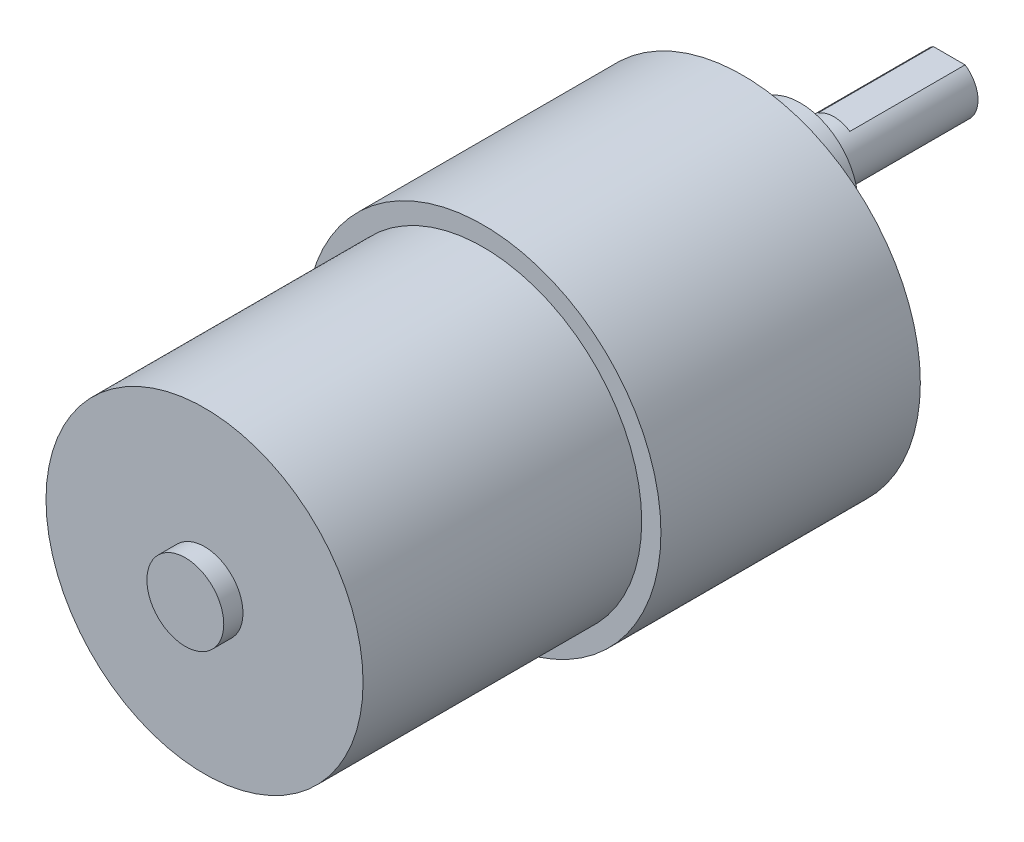
ISO-10303-21;
HEADER;
FILE_DESCRIPTION(('STEP AP214'),'2;1');
FILE_NAME('part.step','',(''),(''),'','','');
FILE_SCHEMA(('AUTOMOTIVE_DESIGN { 1 0 10303 214 1 1 1 1 }'));
ENDSEC;
DATA;
#1=APPLICATION_CONTEXT('core data for automotive mechanical design processes');
#2=APPLICATION_PROTOCOL_DEFINITION('international standard','automotive_design',2000,#1);
#3=PRODUCT_CONTEXT('',#1,'mechanical');
#4=PRODUCT('Part','Part','',(#3));
#5=PRODUCT_RELATED_PRODUCT_CATEGORY('part','',(#4));
#6=PRODUCT_DEFINITION_FORMATION('','',#4);
#7=PRODUCT_DEFINITION_CONTEXT('part definition',#1,'design');
#8=PRODUCT_DEFINITION('design','',#6,#7);
#9=PRODUCT_DEFINITION_SHAPE('','',#8);
#10=(LENGTH_UNIT() NAMED_UNIT(*) SI_UNIT(.MILLI.,.METRE.));
#11=(NAMED_UNIT(*) PLANE_ANGLE_UNIT() SI_UNIT($,.RADIAN.));
#12=(NAMED_UNIT(*) SI_UNIT($,.STERADIAN.) SOLID_ANGLE_UNIT());
#13=UNCERTAINTY_MEASURE_WITH_UNIT(LENGTH_MEASURE(1.E-05),#10,'distance_accuracy_value','');
#14=(GEOMETRIC_REPRESENTATION_CONTEXT(3) GLOBAL_UNCERTAINTY_ASSIGNED_CONTEXT((#13)) GLOBAL_UNIT_ASSIGNED_CONTEXT((#10,
#11,#12)) REPRESENTATION_CONTEXT('',''));
#15=CARTESIAN_POINT('',(0.,0.,0.));
#16=DIRECTION('',(0.,0.,1.));
#17=DIRECTION('',(1.,0.,0.));
#18=AXIS2_PLACEMENT_3D('',#15,#16,#17);
#19=CARTESIAN_POINT('',(0.,0.,27.));
#20=DIRECTION('',(0.,0.,-1.));
#21=DIRECTION('',(-1.,0.,0.));
#22=AXIS2_PLACEMENT_3D('',#19,#20,#21);
#23=CYLINDRICAL_SURFACE('',#22,18.5);
#24=CARTESIAN_POINT('',(0.,0.,27.));
#25=DIRECTION('',(0.,0.,1.));
#26=DIRECTION('',(1.,0.,0.));
#27=AXIS2_PLACEMENT_3D('',#24,#25,#26);
#28=CIRCLE('',#27,18.5);
#29=CARTESIAN_POINT('',(18.5,0.,27.));
#30=VERTEX_POINT('',#29);
#31=EDGE_CURVE('E156',#30,#30,#28,.T.);
#32=ORIENTED_EDGE('',*,*,#31,.F.);
#33=EDGE_LOOP('',(#32));
#34=FACE_BOUND('',#33,.T.);
#35=CARTESIAN_POINT('',(0.,0.,0.));
#36=DIRECTION('',(0.,0.,1.));
#37=DIRECTION('',(1.,0.,0.));
#38=AXIS2_PLACEMENT_3D('',#35,#36,#37);
#39=CIRCLE('',#38,18.5);
#40=CARTESIAN_POINT('',(18.5,0.,0.));
#41=VERTEX_POINT('',#40);
#42=EDGE_CURVE('E153',#41,#41,#39,.T.);
#43=ORIENTED_EDGE('',*,*,#42,.T.);
#44=EDGE_LOOP('',(#43));
#45=FACE_BOUND('',#44,.T.);
#46=ADVANCED_FACE('F41',(#34,#45),#23,.T.);
#47=CARTESIAN_POINT('',(0.,0.,27.));
#48=DIRECTION('',(0.,0.,1.));
#49=DIRECTION('',(1.,0.,0.));
#50=AXIS2_PLACEMENT_3D('',#47,#48,#49);
#51=PLANE('',#50);
#52=CARTESIAN_POINT('',(0.,0.,27.));
#53=DIRECTION('',(0.,0.,1.));
#54=DIRECTION('',(1.,0.,0.));
#55=AXIS2_PLACEMENT_3D('',#52,#53,#54);
#56=CIRCLE('',#55,16.5);
#57=CARTESIAN_POINT('',(16.5,0.,27.));
#58=VERTEX_POINT('',#57);
#59=EDGE_CURVE('E150',#58,#58,#56,.T.);
#60=ORIENTED_EDGE('',*,*,#59,.F.);
#61=EDGE_LOOP('',(#60));
#62=FACE_BOUND('',#61,.T.);
#63=ORIENTED_EDGE('',*,*,#31,.T.);
#64=EDGE_LOOP('',(#63));
#65=FACE_BOUND('',#64,.T.);
#66=ADVANCED_FACE('F169',(#62,#65),#51,.T.);
#67=CARTESIAN_POINT('',(0.,0.,0.));
#68=DIRECTION('',(0.,0.,1.));
#69=DIRECTION('',(1.,0.,0.));
#70=AXIS2_PLACEMENT_3D('',#67,#68,#69);
#71=PLANE('',#70);
#72=CARTESIAN_POINT('',(0.,7.00046553943887,0.));
#73=DIRECTION('',(0.,0.,1.));
#74=DIRECTION('',(1.,0.,0.));
#75=AXIS2_PLACEMENT_3D('',#72,#73,#74);
#76=CIRCLE('',#75,6.);
#77=CARTESIAN_POINT('',(6.,7.00046553943887,0.));
#78=VERTEX_POINT('',#77);
#79=EDGE_CURVE('E104',#78,#78,#76,.F.);
#80=ORIENTED_EDGE('',*,*,#79,.F.);
#81=EDGE_LOOP('',(#80));
#82=FACE_BOUND('',#81,.T.);
#83=CARTESIAN_POINT('',(15.5,-0.17876526458599,0.));
#84=DIRECTION('',(0.,0.,-1.));
#85=DIRECTION('',(-1.,0.,0.));
#86=AXIS2_PLACEMENT_3D('',#83,#84,#85);
#87=CIRCLE('',#86,1.25);
#88=CARTESIAN_POINT('',(14.25,-0.17876526458599,0.));
#89=VERTEX_POINT('',#88);
#90=EDGE_CURVE('E107',#89,#89,#87,.T.);
#91=ORIENTED_EDGE('',*,*,#90,.F.);
#92=EDGE_LOOP('',(#91));
#93=FACE_BOUND('',#92,.T.);
#94=CARTESIAN_POINT('',(7.90481526044568,13.3340111263658,0.));
#95=DIRECTION('',(0.,0.,-1.));
#96=DIRECTION('',(-1.,0.,0.));
#97=AXIS2_PLACEMENT_3D('',#94,#95,#96);
#98=CIRCLE('',#97,1.25);
#99=CARTESIAN_POINT('',(6.65481526044568,13.3340111263658,0.));
#100=VERTEX_POINT('',#99);
#101=EDGE_CURVE('E113',#100,#100,#98,.T.);
#102=ORIENTED_EDGE('',*,*,#101,.F.);
#103=EDGE_LOOP('',(#102));
#104=FACE_BOUND('',#103,.T.);
#105=CARTESIAN_POINT('',(-7.59518473955435,13.5127763909518,0.));
#106=DIRECTION('',(0.,0.,-1.));
#107=DIRECTION('',(-1.,0.,0.));
#108=AXIS2_PLACEMENT_3D('',#105,#106,#107);
#109=CIRCLE('',#108,1.25);
#110=CARTESIAN_POINT('',(-8.84518473955435,13.5127763909518,0.));
#111=VERTEX_POINT('',#110);
#112=EDGE_CURVE('E119',#111,#111,#109,.T.);
#113=ORIENTED_EDGE('',*,*,#112,.F.);
#114=EDGE_LOOP('',(#113));
#115=FACE_BOUND('',#114,.T.);
#116=CARTESIAN_POINT('',(-15.5,0.178765264585881,0.));
#117=DIRECTION('',(0.,0.,-1.));
#118=DIRECTION('',(-1.,0.,0.));
#119=AXIS2_PLACEMENT_3D('',#116,#117,#118);
#120=CIRCLE('',#119,1.25);
#121=CARTESIAN_POINT('',(-16.75,0.178765264585881,0.));
#122=VERTEX_POINT('',#121);
#123=EDGE_CURVE('E125',#122,#122,#120,.T.);
#124=ORIENTED_EDGE('',*,*,#123,.F.);
#125=EDGE_LOOP('',(#124));
#126=FACE_BOUND('',#125,.T.);
#127=CARTESIAN_POINT('',(-7.90481526044559,-13.3340111263659,0.));
#128=DIRECTION('',(0.,0.,-1.));
#129=DIRECTION('',(-1.,0.,0.));
#130=AXIS2_PLACEMENT_3D('',#127,#128,#129);
#131=CIRCLE('',#130,1.25);
#132=CARTESIAN_POINT('',(-9.15481526044559,-13.3340111263659,0.));
#133=VERTEX_POINT('',#132);
#134=EDGE_CURVE('E131',#133,#133,#131,.T.);
#135=ORIENTED_EDGE('',*,*,#134,.F.);
#136=EDGE_LOOP('',(#135));
#137=FACE_BOUND('',#136,.T.);
#138=CARTESIAN_POINT('',(7.59518473955444,-13.5127763909517,0.));
#139=DIRECTION('',(0.,0.,-1.));
#140=DIRECTION('',(-1.,0.,0.));
#141=AXIS2_PLACEMENT_3D('',#138,#139,#140);
#142=CIRCLE('',#141,1.25);
#143=CARTESIAN_POINT('',(6.34518473955445,-13.5127763909517,0.));
#144=VERTEX_POINT('',#143);
#145=EDGE_CURVE('E137',#144,#144,#142,.T.);
#146=ORIENTED_EDGE('',*,*,#145,.F.);
#147=EDGE_LOOP('',(#146));
#148=FACE_BOUND('',#147,.T.);
#149=ORIENTED_EDGE('',*,*,#42,.F.);
#150=EDGE_LOOP('',(#149));
#151=FACE_BOUND('',#150,.T.);
#152=ADVANCED_FACE('F165',(#82,#93,#104,#115,#126,#137,#148,#151),#71,.F.);
#153=CARTESIAN_POINT('',(0.,0.,56.));
#154=DIRECTION('',(0.,0.,-1.));
#155=DIRECTION('',(-1.,0.,0.));
#156=AXIS2_PLACEMENT_3D('',#153,#154,#155);
#157=CYLINDRICAL_SURFACE('',#156,16.5);
#158=CARTESIAN_POINT('',(0.,0.,56.));
#159=DIRECTION('',(0.,0.,1.));
#160=DIRECTION('',(1.,0.,0.));
#161=AXIS2_PLACEMENT_3D('',#158,#159,#160);
#162=CIRCLE('',#161,16.5);
#163=CARTESIAN_POINT('',(16.5,0.,56.));
#164=VERTEX_POINT('',#163);
#165=EDGE_CURVE('E146',#164,#164,#162,.T.);
#166=ORIENTED_EDGE('',*,*,#165,.F.);
#167=EDGE_LOOP('',(#166));
#168=FACE_BOUND('',#167,.T.);
#169=ORIENTED_EDGE('',*,*,#59,.T.);
#170=EDGE_LOOP('',(#169));
#171=FACE_BOUND('',#170,.T.);
#172=ADVANCED_FACE('F168',(#168,#171),#157,.T.);
#173=CARTESIAN_POINT('',(0.,0.,56.));
#174=DIRECTION('',(0.,0.,1.));
#175=DIRECTION('',(1.,0.,0.));
#176=AXIS2_PLACEMENT_3D('',#173,#174,#175);
#177=PLANE('',#176);
#178=CARTESIAN_POINT('',(0.,0.,56.));
#179=DIRECTION('',(0.,0.,1.));
#180=DIRECTION('',(1.,0.,0.));
#181=AXIS2_PLACEMENT_3D('',#178,#179,#180);
#182=CIRCLE('',#181,4.);
#183=CARTESIAN_POINT('',(4.,0.,56.));
#184=VERTEX_POINT('',#183);
#185=EDGE_CURVE('E147',#184,#184,#182,.T.);
#186=ORIENTED_EDGE('',*,*,#185,.F.);
#187=EDGE_LOOP('',(#186));
#188=FACE_BOUND('',#187,.T.);
#189=ORIENTED_EDGE('',*,*,#165,.T.);
#190=EDGE_LOOP('',(#189));
#191=FACE_BOUND('',#190,.T.);
#192=ADVANCED_FACE('F199',(#188,#191),#177,.T.);
#193=CARTESIAN_POINT('',(0.,0.,58.));
#194=DIRECTION('',(0.,0.,-1.));
#195=DIRECTION('',(-1.,0.,0.));
#196=AXIS2_PLACEMENT_3D('',#193,#194,#195);
#197=CYLINDRICAL_SURFACE('',#196,4.);
#198=CARTESIAN_POINT('',(0.,0.,58.));
#199=DIRECTION('',(0.,0.,1.));
#200=DIRECTION('',(1.,0.,0.));
#201=AXIS2_PLACEMENT_3D('',#198,#199,#200);
#202=CIRCLE('',#201,4.);
#203=CARTESIAN_POINT('',(4.,0.,58.));
#204=VERTEX_POINT('',#203);
#205=EDGE_CURVE('E143',#204,#204,#202,.T.);
#206=ORIENTED_EDGE('',*,*,#205,.F.);
#207=EDGE_LOOP('',(#206));
#208=FACE_BOUND('',#207,.T.);
#209=ORIENTED_EDGE('',*,*,#185,.T.);
#210=EDGE_LOOP('',(#209));
#211=FACE_BOUND('',#210,.T.);
#212=ADVANCED_FACE('F203',(#208,#211),#197,.T.);
#213=CARTESIAN_POINT('',(0.,0.,58.));
#214=DIRECTION('',(0.,0.,1.));
#215=DIRECTION('',(1.,0.,0.));
#216=AXIS2_PLACEMENT_3D('',#213,#214,#215);
#217=PLANE('',#216);
#218=ORIENTED_EDGE('',*,*,#205,.T.);
#219=EDGE_LOOP('',(#218));
#220=FACE_BOUND('',#219,.T.);
#221=ADVANCED_FACE('F207',(#220),#217,.T.);
#222=CARTESIAN_POINT('',(7.59518473955444,-13.5127763909517,8.5));
#223=DIRECTION('',(0.,0.,-1.));
#224=DIRECTION('',(-1.,0.,0.));
#225=AXIS2_PLACEMENT_3D('',#222,#223,#224);
#226=CONICAL_SURFACE('',#225,1.25,1.02974425867665);
#227=CARTESIAN_POINT('',(7.59518473955444,-13.5127763909517,9.25107577378445));
#228=VERTEX_POINT('',#227);
#229=VERTEX_LOOP('',#228);
#230=FACE_BOUND('',#229,.T.);
#231=CARTESIAN_POINT('',(7.59518473955444,-13.5127763909517,8.5));
#232=DIRECTION('',(0.,0.,-1.));
#233=DIRECTION('',(-1.,0.,0.));
#234=AXIS2_PLACEMENT_3D('',#231,#232,#233);
#235=CIRCLE('',#234,1.25);
#236=CARTESIAN_POINT('',(6.34518473955445,-13.5127763909517,8.5));
#237=VERTEX_POINT('',#236);
#238=EDGE_CURVE('E140',#237,#237,#235,.T.);
#239=ORIENTED_EDGE('',*,*,#238,.T.);
#240=EDGE_LOOP('',(#239));
#241=FACE_BOUND('',#240,.T.);
#242=ADVANCED_FACE('F211',(#230,#241),#226,.F.);
#243=CARTESIAN_POINT('',(7.59518473955444,-13.5127763909517,0.));
#244=DIRECTION('',(0.,0.,-1.));
#245=DIRECTION('',(-1.,0.,0.));
#246=AXIS2_PLACEMENT_3D('',#243,#244,#245);
#247=CYLINDRICAL_SURFACE('',#246,1.25);
#248=ORIENTED_EDGE('',*,*,#238,.F.);
#249=EDGE_LOOP('',(#248));
#250=FACE_BOUND('',#249,.T.);
#251=ORIENTED_EDGE('',*,*,#145,.T.);
#252=EDGE_LOOP('',(#251));
#253=FACE_BOUND('',#252,.T.);
#254=ADVANCED_FACE('F215',(#250,#253),#247,.F.);
#255=CARTESIAN_POINT('',(-7.90481526044559,-13.3340111263659,8.5));
#256=DIRECTION('',(0.,0.,-1.));
#257=DIRECTION('',(-1.,0.,0.));
#258=AXIS2_PLACEMENT_3D('',#255,#256,#257);
#259=CONICAL_SURFACE('',#258,1.25,1.02974425867665);
#260=CARTESIAN_POINT('',(-7.90481526044559,-13.3340111263659,9.25107577378445));
#261=VERTEX_POINT('',#260);
#262=VERTEX_LOOP('',#261);
#263=FACE_BOUND('',#262,.T.);
#264=CARTESIAN_POINT('',(-7.90481526044559,-13.3340111263659,8.5));
#265=DIRECTION('',(0.,0.,-1.));
#266=DIRECTION('',(-1.,0.,0.));
#267=AXIS2_PLACEMENT_3D('',#264,#265,#266);
#268=CIRCLE('',#267,1.25);
#269=CARTESIAN_POINT('',(-9.15481526044559,-13.3340111263659,8.5));
#270=VERTEX_POINT('',#269);
#271=EDGE_CURVE('E134',#270,#270,#268,.T.);
#272=ORIENTED_EDGE('',*,*,#271,.T.);
#273=EDGE_LOOP('',(#272));
#274=FACE_BOUND('',#273,.T.);
#275=ADVANCED_FACE('F219',(#263,#274),#259,.F.);
#276=CARTESIAN_POINT('',(-7.90481526044559,-13.3340111263659,0.));
#277=DIRECTION('',(0.,0.,-1.));
#278=DIRECTION('',(-1.,0.,0.));
#279=AXIS2_PLACEMENT_3D('',#276,#277,#278);
#280=CYLINDRICAL_SURFACE('',#279,1.25);
#281=ORIENTED_EDGE('',*,*,#271,.F.);
#282=EDGE_LOOP('',(#281));
#283=FACE_BOUND('',#282,.T.);
#284=ORIENTED_EDGE('',*,*,#134,.T.);
#285=EDGE_LOOP('',(#284));
#286=FACE_BOUND('',#285,.T.);
#287=ADVANCED_FACE('F223',(#283,#286),#280,.F.);
#288=CARTESIAN_POINT('',(-15.5,0.178765264585881,8.5));
#289=DIRECTION('',(0.,0.,-1.));
#290=DIRECTION('',(-1.,0.,0.));
#291=AXIS2_PLACEMENT_3D('',#288,#289,#290);
#292=CONICAL_SURFACE('',#291,1.25,1.02974425867665);
#293=CARTESIAN_POINT('',(-15.5,0.178765264585881,9.25107577378445));
#294=VERTEX_POINT('',#293);
#295=VERTEX_LOOP('',#294);
#296=FACE_BOUND('',#295,.T.);
#297=CARTESIAN_POINT('',(-15.5,0.178765264585881,8.5));
#298=DIRECTION('',(0.,0.,-1.));
#299=DIRECTION('',(-1.,0.,0.));
#300=AXIS2_PLACEMENT_3D('',#297,#298,#299);
#301=CIRCLE('',#300,1.25);
#302=CARTESIAN_POINT('',(-16.75,0.178765264585881,8.5));
#303=VERTEX_POINT('',#302);
#304=EDGE_CURVE('E128',#303,#303,#301,.T.);
#305=ORIENTED_EDGE('',*,*,#304,.T.);
#306=EDGE_LOOP('',(#305));
#307=FACE_BOUND('',#306,.T.);
#308=ADVANCED_FACE('F227',(#296,#307),#292,.F.);
#309=CARTESIAN_POINT('',(-15.5,0.178765264585881,0.));
#310=DIRECTION('',(0.,0.,-1.));
#311=DIRECTION('',(-1.,0.,0.));
#312=AXIS2_PLACEMENT_3D('',#309,#310,#311);
#313=CYLINDRICAL_SURFACE('',#312,1.25);
#314=ORIENTED_EDGE('',*,*,#304,.F.);
#315=EDGE_LOOP('',(#314));
#316=FACE_BOUND('',#315,.T.);
#317=ORIENTED_EDGE('',*,*,#123,.T.);
#318=EDGE_LOOP('',(#317));
#319=FACE_BOUND('',#318,.T.);
#320=ADVANCED_FACE('F231',(#316,#319),#313,.F.);
#321=CARTESIAN_POINT('',(-7.59518473955435,13.5127763909518,8.5));
#322=DIRECTION('',(0.,0.,-1.));
#323=DIRECTION('',(-1.,0.,0.));
#324=AXIS2_PLACEMENT_3D('',#321,#322,#323);
#325=CONICAL_SURFACE('',#324,1.25,1.02974425867665);
#326=CARTESIAN_POINT('',(-7.59518473955435,13.5127763909518,9.25107577378445));
#327=VERTEX_POINT('',#326);
#328=VERTEX_LOOP('',#327);
#329=FACE_BOUND('',#328,.T.);
#330=CARTESIAN_POINT('',(-7.59518473955435,13.5127763909518,8.5));
#331=DIRECTION('',(0.,0.,-1.));
#332=DIRECTION('',(-1.,0.,0.));
#333=AXIS2_PLACEMENT_3D('',#330,#331,#332);
#334=CIRCLE('',#333,1.25);
#335=CARTESIAN_POINT('',(-8.84518473955435,13.5127763909518,8.5));
#336=VERTEX_POINT('',#335);
#337=EDGE_CURVE('E122',#336,#336,#334,.T.);
#338=ORIENTED_EDGE('',*,*,#337,.T.);
#339=EDGE_LOOP('',(#338));
#340=FACE_BOUND('',#339,.T.);
#341=ADVANCED_FACE('F235',(#329,#340),#325,.F.);
#342=CARTESIAN_POINT('',(-7.59518473955435,13.5127763909518,0.));
#343=DIRECTION('',(0.,0.,-1.));
#344=DIRECTION('',(-1.,0.,0.));
#345=AXIS2_PLACEMENT_3D('',#342,#343,#344);
#346=CYLINDRICAL_SURFACE('',#345,1.25);
#347=ORIENTED_EDGE('',*,*,#337,.F.);
#348=EDGE_LOOP('',(#347));
#349=FACE_BOUND('',#348,.T.);
#350=ORIENTED_EDGE('',*,*,#112,.T.);
#351=EDGE_LOOP('',(#350));
#352=FACE_BOUND('',#351,.T.);
#353=ADVANCED_FACE('F239',(#349,#352),#346,.F.);
#354=CARTESIAN_POINT('',(7.90481526044568,13.3340111263658,8.5));
#355=DIRECTION('',(0.,0.,-1.));
#356=DIRECTION('',(-1.,0.,0.));
#357=AXIS2_PLACEMENT_3D('',#354,#355,#356);
#358=CONICAL_SURFACE('',#357,1.25,1.02974425867665);
#359=CARTESIAN_POINT('',(7.90481526044568,13.3340111263658,9.25107577378445));
#360=VERTEX_POINT('',#359);
#361=VERTEX_LOOP('',#360);
#362=FACE_BOUND('',#361,.T.);
#363=CARTESIAN_POINT('',(7.90481526044568,13.3340111263658,8.5));
#364=DIRECTION('',(0.,0.,-1.));
#365=DIRECTION('',(-1.,0.,0.));
#366=AXIS2_PLACEMENT_3D('',#363,#364,#365);
#367=CIRCLE('',#366,1.25);
#368=CARTESIAN_POINT('',(6.65481526044569,13.3340111263658,8.5));
#369=VERTEX_POINT('',#368);
#370=EDGE_CURVE('E116',#369,#369,#367,.T.);
#371=ORIENTED_EDGE('',*,*,#370,.T.);
#372=EDGE_LOOP('',(#371));
#373=FACE_BOUND('',#372,.T.);
#374=ADVANCED_FACE('F243',(#362,#373),#358,.F.);
#375=CARTESIAN_POINT('',(7.90481526044568,13.3340111263658,0.));
#376=DIRECTION('',(0.,0.,-1.));
#377=DIRECTION('',(-1.,0.,0.));
#378=AXIS2_PLACEMENT_3D('',#375,#376,#377);
#379=CYLINDRICAL_SURFACE('',#378,1.25);
#380=ORIENTED_EDGE('',*,*,#370,.F.);
#381=EDGE_LOOP('',(#380));
#382=FACE_BOUND('',#381,.T.);
#383=ORIENTED_EDGE('',*,*,#101,.T.);
#384=EDGE_LOOP('',(#383));
#385=FACE_BOUND('',#384,.T.);
#386=ADVANCED_FACE('F247',(#382,#385),#379,.F.);
#387=CARTESIAN_POINT('',(15.5,-0.17876526458599,8.5));
#388=DIRECTION('',(0.,0.,-1.));
#389=DIRECTION('',(-1.,0.,0.));
#390=AXIS2_PLACEMENT_3D('',#387,#388,#389);
#391=CONICAL_SURFACE('',#390,1.25,1.02974425867665);
#392=CARTESIAN_POINT('',(15.5,-0.17876526458599,9.25107577378445));
#393=VERTEX_POINT('',#392);
#394=VERTEX_LOOP('',#393);
#395=FACE_BOUND('',#394,.T.);
#396=CARTESIAN_POINT('',(15.5,-0.17876526458599,8.5));
#397=DIRECTION('',(0.,0.,-1.));
#398=DIRECTION('',(-1.,0.,0.));
#399=AXIS2_PLACEMENT_3D('',#396,#397,#398);
#400=CIRCLE('',#399,1.25);
#401=CARTESIAN_POINT('',(14.25,-0.17876526458599,8.5));
#402=VERTEX_POINT('',#401);
#403=EDGE_CURVE('E110',#402,#402,#400,.T.);
#404=ORIENTED_EDGE('',*,*,#403,.T.);
#405=EDGE_LOOP('',(#404));
#406=FACE_BOUND('',#405,.T.);
#407=ADVANCED_FACE('F251',(#395,#406),#391,.F.);
#408=CARTESIAN_POINT('',(15.5,-0.17876526458599,0.));
#409=DIRECTION('',(0.,0.,-1.));
#410=DIRECTION('',(-1.,0.,0.));
#411=AXIS2_PLACEMENT_3D('',#408,#409,#410);
#412=CYLINDRICAL_SURFACE('',#411,1.25);
#413=ORIENTED_EDGE('',*,*,#403,.F.);
#414=EDGE_LOOP('',(#413));
#415=FACE_BOUND('',#414,.T.);
#416=ORIENTED_EDGE('',*,*,#90,.T.);
#417=EDGE_LOOP('',(#416));
#418=FACE_BOUND('',#417,.T.);
#419=ADVANCED_FACE('F255',(#415,#418),#412,.F.);
#420=CARTESIAN_POINT('',(0.,7.00046553943887,-6.));
#421=DIRECTION('',(0.,0.,1.));
#422=DIRECTION('',(1.,0.,0.));
#423=AXIS2_PLACEMENT_3D('',#420,#421,#422);
#424=CYLINDRICAL_SURFACE('',#423,6.);
#425=CARTESIAN_POINT('',(0.,7.00046553943887,-6.));
#426=DIRECTION('',(0.,0.,-1.));
#427=DIRECTION('',(-1.,0.,0.));
#428=AXIS2_PLACEMENT_3D('',#425,#426,#427);
#429=CIRCLE('',#428,6.);
#430=CARTESIAN_POINT('',(-6.,7.00046553943887,-6.));
#431=VERTEX_POINT('',#430);
#432=EDGE_CURVE('E101',#431,#431,#429,.T.);
#433=ORIENTED_EDGE('',*,*,#432,.F.);
#434=EDGE_LOOP('',(#433));
#435=FACE_BOUND('',#434,.T.);
#436=ORIENTED_EDGE('',*,*,#79,.T.);
#437=EDGE_LOOP('',(#436));
#438=FACE_BOUND('',#437,.T.);
#439=ADVANCED_FACE('F163',(#435,#438),#424,.T.);
#440=CARTESIAN_POINT('',(0.,0.,-6.));
#441=DIRECTION('',(0.,0.,-1.));
#442=DIRECTION('',(-1.,0.,0.));
#443=AXIS2_PLACEMENT_3D('',#440,#441,#442);
#444=PLANE('',#443);
#445=CARTESIAN_POINT('',(0.,7.00046553943887,-6.));
#446=DIRECTION('',(0.,0.,-1.));
#447=DIRECTION('',(-1.,0.,0.));
#448=AXIS2_PLACEMENT_3D('',#445,#446,#447);
#449=CIRCLE('',#448,3.);
#450=CARTESIAN_POINT('',(-3.,7.00046553943887,-6.));
#451=VERTEX_POINT('',#450);
#452=EDGE_CURVE('E49',#451,#451,#449,.T.);
#453=ORIENTED_EDGE('',*,*,#452,.F.);
#454=EDGE_LOOP('',(#453));
#455=FACE_BOUND('',#454,.T.);
#456=ORIENTED_EDGE('',*,*,#432,.T.);
#457=EDGE_LOOP('',(#456));
#458=FACE_BOUND('',#457,.T.);
#459=ADVANCED_FACE('F262',(#455,#458),#444,.T.);
#460=CARTESIAN_POINT('',(0.,7.00046553943887,-21.5));
#461=DIRECTION('',(0.,0.,1.));
#462=DIRECTION('',(1.,0.,0.));
#463=AXIS2_PLACEMENT_3D('',#460,#461,#462);
#464=CYLINDRICAL_SURFACE('',#463,3.);
#465=CARTESIAN_POINT('',(0.,7.00046553943887,-21.5));
#466=DIRECTION('',(0.,0.,-1.));
#467=DIRECTION('',(-1.,0.,0.));
#468=AXIS2_PLACEMENT_3D('',#465,#466,#467);
#469=CIRCLE('',#468,3.);
#470=CARTESIAN_POINT('',(1.6583123951777,9.50046553943887,-21.5));
#471=VERTEX_POINT('',#470);
#472=CARTESIAN_POINT('',(-1.6583123951777,9.50046553943887,-21.5));
#473=VERTEX_POINT('',#472);
#474=EDGE_CURVE('E96',#471,#473,#469,.T.);
#475=ORIENTED_EDGE('',*,*,#474,.F.);
#476=DIRECTION('',(0.,0.,-1.));
#477=VECTOR('',#476,1.);
#478=CARTESIAN_POINT('',(1.6583123951777,9.50046553943887,-9.5));
#479=LINE('',#478,#477);
#480=CARTESIAN_POINT('',(1.6583123951777,9.50046553943887,-9.5));
#481=VERTEX_POINT('',#480);
#482=EDGE_CURVE('E55',#481,#471,#479,.T.);
#483=ORIENTED_EDGE('',*,*,#482,.F.);
#484=CARTESIAN_POINT('',(0.,7.00046553943887,-9.5));
#485=DIRECTION('',(0.,0.,-1.));
#486=DIRECTION('',(-1.,0.,0.));
#487=AXIS2_PLACEMENT_3D('',#484,#485,#486);
#488=CIRCLE('',#487,3.);
#489=CARTESIAN_POINT('',(-1.6583123951777,9.50046553943887,-9.5));
#490=VERTEX_POINT('',#489);
#491=EDGE_CURVE('E83',#490,#481,#488,.T.);
#492=ORIENTED_EDGE('',*,*,#491,.F.);
#493=DIRECTION('',(0.,0.,-1.));
#494=VECTOR('',#493,1.);
#495=CARTESIAN_POINT('',(-1.6583123951777,9.50046553943887,-9.5));
#496=LINE('',#495,#494);
#497=EDGE_CURVE('E90',#490,#473,#496,.T.);
#498=ORIENTED_EDGE('',*,*,#497,.T.);
#499=EDGE_LOOP('',(#475,#483,#492,#498));
#500=FACE_BOUND('',#499,.T.);
#501=ORIENTED_EDGE('',*,*,#452,.T.);
#502=EDGE_LOOP('',(#501));
#503=FACE_BOUND('',#502,.T.);
#504=ADVANCED_FACE('F93',(#500,#503),#464,.T.);
#505=CARTESIAN_POINT('',(0.,7.00046553943887,-21.5));
#506=DIRECTION('',(0.,0.,-1.));
#507=DIRECTION('',(-1.,0.,0.));
#508=AXIS2_PLACEMENT_3D('',#505,#506,#507);
#509=PLANE('',#508);
#510=DIRECTION('',(1.,0.,0.));
#511=VECTOR('',#510,1.);
#512=CARTESIAN_POINT('',(0.,9.50046553943887,-21.5));
#513=LINE('',#512,#511);
#514=EDGE_CURVE('E11',#471,#473,#513,.F.);
#515=ORIENTED_EDGE('',*,*,#514,.F.);
#516=ORIENTED_EDGE('',*,*,#474,.T.);
#517=EDGE_LOOP('',(#515,#516));
#518=FACE_BOUND('',#517,.T.);
#519=ADVANCED_FACE('F269',(#518),#509,.T.);
#520=CARTESIAN_POINT('',(0.,9.50046553943887,-9.5));
#521=DIRECTION('',(0.,-1.,0.));
#522=DIRECTION('',(0.,0.,-1.));
#523=AXIS2_PLACEMENT_3D('',#520,#521,#522);
#524=PLANE('',#523);
#525=ORIENTED_EDGE('',*,*,#514,.T.);
#526=ORIENTED_EDGE('',*,*,#497,.F.);
#527=DIRECTION('',(-1.,0.,0.));
#528=VECTOR('',#527,1.);
#529=CARTESIAN_POINT('',(0.,9.50046553943887,-9.5));
#530=LINE('',#529,#528);
#531=EDGE_CURVE('E85',#481,#490,#530,.T.);
#532=ORIENTED_EDGE('',*,*,#531,.F.);
#533=ORIENTED_EDGE('',*,*,#482,.T.);
#534=EDGE_LOOP('',(#525,#526,#532,#533));
#535=FACE_BOUND('',#534,.T.);
#536=ADVANCED_FACE('F89',(#535),#524,.F.);
#537=CARTESIAN_POINT('',(0.,0.,-9.5));
#538=DIRECTION('',(0.,0.,-1.));
#539=DIRECTION('',(-1.,0.,0.));
#540=AXIS2_PLACEMENT_3D('',#537,#538,#539);
#541=PLANE('',#540);
#542=ORIENTED_EDGE('',*,*,#491,.T.);
#543=ORIENTED_EDGE('',*,*,#531,.T.);
#544=EDGE_LOOP('',(#542,#543));
#545=FACE_BOUND('',#544,.T.);
#546=ADVANCED_FACE('F84',(#545),#541,.T.);
#547=CLOSED_SHELL('',(#46,#66,#152,#172,#192,#212,#221,#242,#254,#275,#287,#308,#320,#341,#353,
#374,#386,#407,#419,#439,#459,#504,#519,#536,#546));
#548=MANIFOLD_SOLID_BREP('B2',#547);
#549=ADVANCED_BREP_SHAPE_REPRESENTATION('',(#18,#548),#14);
#550=SHAPE_DEFINITION_REPRESENTATION(#9,#549);
ENDSEC;
END-ISO-10303-21;
